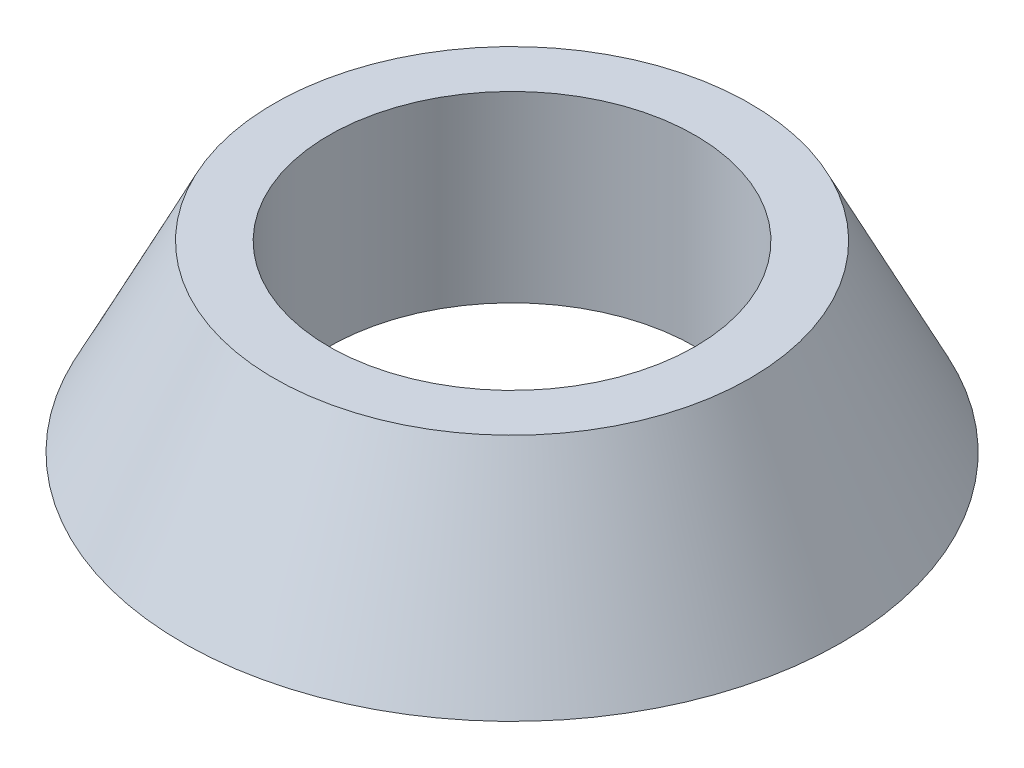
ISO-10303-21;
HEADER;
FILE_DESCRIPTION(('STEP AP214'),'2;1');
FILE_NAME('part.step','',(''),(''),'','','');
FILE_SCHEMA(('AUTOMOTIVE_DESIGN { 1 0 10303 214 1 1 1 1 }'));
ENDSEC;
DATA;
#1=APPLICATION_CONTEXT('core data for automotive mechanical design processes');
#2=APPLICATION_PROTOCOL_DEFINITION('international standard','automotive_design',2000,#1);
#3=PRODUCT_CONTEXT('',#1,'mechanical');
#4=PRODUCT('Part','Part','',(#3));
#5=PRODUCT_RELATED_PRODUCT_CATEGORY('part','',(#4));
#6=PRODUCT_DEFINITION_FORMATION('','',#4);
#7=PRODUCT_DEFINITION_CONTEXT('part definition',#1,'design');
#8=PRODUCT_DEFINITION('design','',#6,#7);
#9=PRODUCT_DEFINITION_SHAPE('','',#8);
#10=(LENGTH_UNIT() NAMED_UNIT(*) SI_UNIT(.MILLI.,.METRE.));
#11=(NAMED_UNIT(*) PLANE_ANGLE_UNIT() SI_UNIT($,.RADIAN.));
#12=(NAMED_UNIT(*) SI_UNIT($,.STERADIAN.) SOLID_ANGLE_UNIT());
#13=UNCERTAINTY_MEASURE_WITH_UNIT(LENGTH_MEASURE(1.E-05),#10,'distance_accuracy_value','');
#14=(GEOMETRIC_REPRESENTATION_CONTEXT(3) GLOBAL_UNCERTAINTY_ASSIGNED_CONTEXT((#13)) GLOBAL_UNIT_ASSIGNED_CONTEXT((#10,
#11,#12)) REPRESENTATION_CONTEXT('',''));
#15=CARTESIAN_POINT('',(0.,0.,0.));
#16=DIRECTION('',(0.,0.,1.));
#17=DIRECTION('',(1.,0.,0.));
#18=AXIS2_PLACEMENT_3D('',#15,#16,#17);
#19=CARTESIAN_POINT('',(9.,0.,0.));
#20=DIRECTION('',(0.,-1.,0.));
#21=DIRECTION('',(1.,0.,0.));
#22=AXIS2_PLACEMENT_3D('',#19,#20,#21);
#23=PLANE('',#22);
#24=CARTESIAN_POINT('',(0.,0.,0.));
#25=DIRECTION('',(0.,-1.,0.));
#26=DIRECTION('',(1.,0.,0.));
#27=AXIS2_PLACEMENT_3D('',#24,#25,#26);
#28=CIRCLE('',#27,9.);
#29=CARTESIAN_POINT('',(9.,0.,0.));
#30=VERTEX_POINT('',#29);
#31=EDGE_CURVE('E46',#30,#30,#28,.T.);
#32=ORIENTED_EDGE('',*,*,#31,.T.);
#33=EDGE_LOOP('',(#32));
#34=FACE_BOUND('',#33,.T.);
#35=CARTESIAN_POINT('',(0.,0.,0.));
#36=DIRECTION('',(0.,-1.,0.));
#37=DIRECTION('',(1.,0.,0.));
#38=AXIS2_PLACEMENT_3D('',#35,#36,#37);
#39=CIRCLE('',#38,5.);
#40=CARTESIAN_POINT('',(5.,0.,0.));
#41=VERTEX_POINT('',#40);
#42=EDGE_CURVE('E10',#41,#41,#39,.T.);
#43=ORIENTED_EDGE('',*,*,#42,.F.);
#44=EDGE_LOOP('',(#43));
#45=FACE_BOUND('',#44,.T.);
#46=ADVANCED_FACE('F32',(#34,#45),#23,.T.);
#47=CARTESIAN_POINT('',(0.,0.,0.));
#48=DIRECTION('',(0.,-1.,0.));
#49=DIRECTION('',(1.,0.,0.));
#50=AXIS2_PLACEMENT_3D('',#47,#48,#49);
#51=CYLINDRICAL_SURFACE('',#50,5.00000000000001);
#52=ORIENTED_EDGE('',*,*,#42,.T.);
#53=EDGE_LOOP('',(#52));
#54=FACE_BOUND('',#53,.T.);
#55=CARTESIAN_POINT('',(0.,4.99999999999998,0.));
#56=DIRECTION('',(0.,-1.,0.));
#57=DIRECTION('',(1.,0.,0.));
#58=AXIS2_PLACEMENT_3D('',#55,#56,#57);
#59=CIRCLE('',#58,5.00000000000002);
#60=CARTESIAN_POINT('',(5.,5.,0.));
#61=VERTEX_POINT('',#60);
#62=EDGE_CURVE('E38',#61,#61,#59,.T.);
#63=ORIENTED_EDGE('',*,*,#62,.F.);
#64=EDGE_LOOP('',(#63));
#65=FACE_BOUND('',#64,.T.);
#66=ADVANCED_FACE('F62',(#54,#65),#51,.F.);
#67=CARTESIAN_POINT('',(5.,5.,0.));
#68=DIRECTION('',(0.,1.,0.));
#69=DIRECTION('',(-1.,0.,0.));
#70=AXIS2_PLACEMENT_3D('',#67,#68,#69);
#71=PLANE('',#70);
#72=ORIENTED_EDGE('',*,*,#62,.T.);
#73=EDGE_LOOP('',(#72));
#74=FACE_BOUND('',#73,.T.);
#75=CARTESIAN_POINT('',(0.,4.99999999999998,0.));
#76=DIRECTION('',(0.,-1.,0.));
#77=DIRECTION('',(1.,0.,0.));
#78=AXIS2_PLACEMENT_3D('',#75,#76,#77);
#79=CIRCLE('',#78,6.50000000000002);
#80=CARTESIAN_POINT('',(6.5,5.,0.));
#81=VERTEX_POINT('',#80);
#82=EDGE_CURVE('E42',#81,#81,#79,.T.);
#83=ORIENTED_EDGE('',*,*,#82,.F.);
#84=EDGE_LOOP('',(#83));
#85=FACE_BOUND('',#84,.T.);
#86=ADVANCED_FACE('F56',(#74,#85),#71,.T.);
#87=CARTESIAN_POINT('',(0.,0.,0.));
#88=DIRECTION('',(0.,-1.,0.));
#89=DIRECTION('',(1.,0.,0.));
#90=AXIS2_PLACEMENT_3D('',#87,#88,#89);
#91=CONICAL_SURFACE('',#90,9.,0.463647609000802);
#92=ORIENTED_EDGE('',*,*,#82,.T.);
#93=EDGE_LOOP('',(#92));
#94=FACE_BOUND('',#93,.T.);
#95=ORIENTED_EDGE('',*,*,#31,.F.);
#96=EDGE_LOOP('',(#95));
#97=FACE_BOUND('',#96,.T.);
#98=ADVANCED_FACE('F54',(#94,#97),#91,.T.);
#99=CLOSED_SHELL('',(#46,#66,#86,#98));
#100=MANIFOLD_SOLID_BREP('B2',#99);
#101=ADVANCED_BREP_SHAPE_REPRESENTATION('',(#18,#100),#14);
#102=SHAPE_DEFINITION_REPRESENTATION(#9,#101);
ENDSEC;
END-ISO-10303-21;
